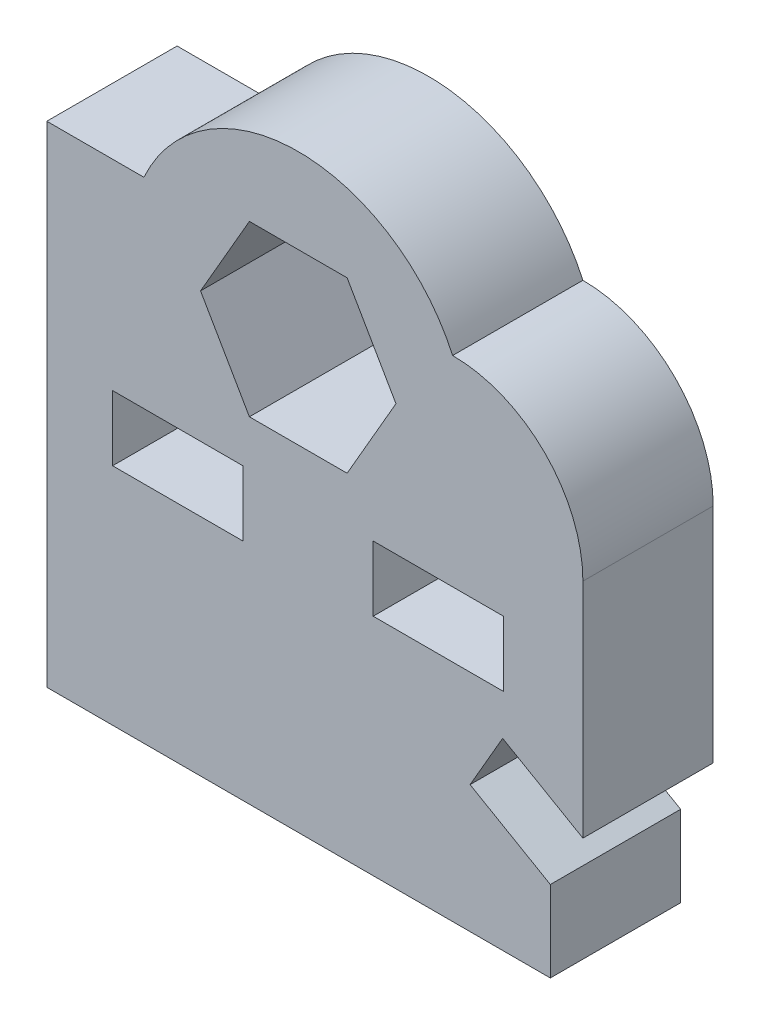
ISO-10303-21;
HEADER;
FILE_DESCRIPTION(('STEP AP214'),'2;1');
FILE_NAME('part.step','',(''),(''),'','','');
FILE_SCHEMA(('AUTOMOTIVE_DESIGN { 1 0 10303 214 1 1 1 1 }'));
ENDSEC;
DATA;
#1=APPLICATION_CONTEXT('core data for automotive mechanical design processes');
#2=APPLICATION_PROTOCOL_DEFINITION('international standard','automotive_design',2000,#1);
#3=PRODUCT_CONTEXT('',#1,'mechanical');
#4=PRODUCT('Part','Part','',(#3));
#5=PRODUCT_RELATED_PRODUCT_CATEGORY('part','',(#4));
#6=PRODUCT_DEFINITION_FORMATION('','',#4);
#7=PRODUCT_DEFINITION_CONTEXT('part definition',#1,'design');
#8=PRODUCT_DEFINITION('design','',#6,#7);
#9=PRODUCT_DEFINITION_SHAPE('','',#8);
#10=(LENGTH_UNIT() NAMED_UNIT(*) SI_UNIT(.MILLI.,.METRE.));
#11=(NAMED_UNIT(*) PLANE_ANGLE_UNIT() SI_UNIT($,.RADIAN.));
#12=(NAMED_UNIT(*) SI_UNIT($,.STERADIAN.) SOLID_ANGLE_UNIT());
#13=UNCERTAINTY_MEASURE_WITH_UNIT(LENGTH_MEASURE(1.E-05),#10,'distance_accuracy_value','');
#14=(GEOMETRIC_REPRESENTATION_CONTEXT(3) GLOBAL_UNCERTAINTY_ASSIGNED_CONTEXT((#13)) GLOBAL_UNIT_ASSIGNED_CONTEXT((#10,
#11,#12)) REPRESENTATION_CONTEXT('',''));
#15=CARTESIAN_POINT('',(0.,0.,0.));
#16=DIRECTION('',(0.,0.,1.));
#17=DIRECTION('',(1.,0.,0.));
#18=AXIS2_PLACEMENT_3D('',#15,#16,#17);
#19=CARTESIAN_POINT('',(13.9396736813884,13.1425512647541,4.));
#20=DIRECTION('',(0.,0.,1.));
#21=DIRECTION('',(1.,0.,0.));
#22=AXIS2_PLACEMENT_3D('',#19,#20,#21);
#23=PLANE('',#22);
#24=DIRECTION('',(0.,-1.,0.));
#25=VECTOR('',#24,1.);
#26=CARTESIAN_POINT('',(11.5,8.99107807997269,4.));
#27=LINE('',#26,#25);
#28=CARTESIAN_POINT('',(11.5,10.9910780799727,4.));
#29=VERTEX_POINT('',#28);
#30=CARTESIAN_POINT('',(11.5,8.99107807997269,4.));
#31=VERTEX_POINT('',#30);
#32=EDGE_CURVE('E246',#29,#31,#27,.T.);
#33=ORIENTED_EDGE('',*,*,#32,.F.);
#34=DIRECTION('',(-1.,0.,0.));
#35=VECTOR('',#34,1.);
#36=CARTESIAN_POINT('',(11.5,10.9910780799727,4.));
#37=LINE('',#36,#35);
#38=CARTESIAN_POINT('',(15.5,10.9910780799727,4.));
#39=VERTEX_POINT('',#38);
#40=EDGE_CURVE('E244',#39,#29,#37,.T.);
#41=ORIENTED_EDGE('',*,*,#40,.F.);
#42=DIRECTION('',(0.,1.,0.));
#43=VECTOR('',#42,1.);
#44=CARTESIAN_POINT('',(15.5,8.99107807997269,4.));
#45=LINE('',#44,#43);
#46=CARTESIAN_POINT('',(15.5,8.99107807997269,4.));
#47=VERTEX_POINT('',#46);
#48=EDGE_CURVE('E252',#47,#39,#45,.T.);
#49=ORIENTED_EDGE('',*,*,#48,.F.);
#50=DIRECTION('',(1.,0.,0.));
#51=VECTOR('',#50,1.);
#52=CARTESIAN_POINT('',(11.5,8.99107807997269,4.));
#53=LINE('',#52,#51);
#54=EDGE_CURVE('E249',#31,#47,#53,.T.);
#55=ORIENTED_EDGE('',*,*,#54,.F.);
#56=EDGE_LOOP('',(#33,#41,#49,#55));
#57=FACE_BOUND('',#56,.T.);
#58=CARTESIAN_POINT('',(13.9396736813884,13.1425512647541,4.));
#59=DIRECTION('',(0.,0.,1.));
#60=DIRECTION('',(1.,0.,0.));
#61=AXIS2_PLACEMENT_3D('',#58,#59,#60);
#62=CIRCLE('',#61,4.);
#63=CARTESIAN_POINT('',(17.9396736813884,13.142551264754,4.));
#64=VERTEX_POINT('',#63);
#65=CARTESIAN_POINT('',(13.9396736813883,17.1425512647541,4.));
#66=VERTEX_POINT('',#65);
#67=EDGE_CURVE('E306',#64,#66,#62,.T.);
#68=ORIENTED_EDGE('',*,*,#67,.T.);
#69=CARTESIAN_POINT('',(9.20000000000002,14.992551264754,4.));
#70=DIRECTION('',(0.,0.,1.));
#71=DIRECTION('',(1.,0.,0.));
#72=AXIS2_PLACEMENT_3D('',#69,#70,#71);
#73=CIRCLE('',#72,5.20451790332642);
#74=CARTESIAN_POINT('',(4.46032631861171,17.1425512647541,4.));
#75=VERTEX_POINT('',#74);
#76=EDGE_CURVE('E309',#66,#75,#73,.T.);
#77=ORIENTED_EDGE('',*,*,#76,.T.);
#78=DIRECTION('',(-1.,0.,0.));
#79=VECTOR('',#78,1.);
#80=CARTESIAN_POINT('',(4.46032631861171,17.1425512647541,4.));
#81=LINE('',#80,#79);
#82=CARTESIAN_POINT('',(1.48,17.1425512647541,4.));
#83=VERTEX_POINT('',#82);
#84=EDGE_CURVE('E312',#75,#83,#81,.T.);
#85=ORIENTED_EDGE('',*,*,#84,.T.);
#86=DIRECTION('',(0.,-1.,0.));
#87=VECTOR('',#86,1.);
#88=CARTESIAN_POINT('',(1.48,17.1425512647541,4.));
#89=LINE('',#88,#87);
#90=CARTESIAN_POINT('',(1.48,2.0910780799727,4.));
#91=VERTEX_POINT('',#90);
#92=EDGE_CURVE('E314',#83,#91,#89,.T.);
#93=ORIENTED_EDGE('',*,*,#92,.T.);
#94=DIRECTION('',(1.,0.,0.));
#95=VECTOR('',#94,1.);
#96=CARTESIAN_POINT('',(16.9396736813884,2.0910780799727,4.));
#97=LINE('',#96,#95);
#98=CARTESIAN_POINT('',(16.9396736813884,2.0910780799727,4.));
#99=VERTEX_POINT('',#98);
#100=EDGE_CURVE('E316',#91,#99,#97,.T.);
#101=ORIENTED_EDGE('',*,*,#100,.T.);
#102=DIRECTION('',(0.,1.,0.));
#103=VECTOR('',#102,1.);
#104=CARTESIAN_POINT('',(16.9396736813884,4.57735026918963,4.));
#105=LINE('',#104,#103);
#106=CARTESIAN_POINT('',(16.9396736813884,4.57735026918963,4.));
#107=VERTEX_POINT('',#106);
#108=EDGE_CURVE('E318',#99,#107,#105,.T.);
#109=ORIENTED_EDGE('',*,*,#108,.T.);
#110=DIRECTION('',(-0.866025403784438,0.5,0.));
#111=VECTOR('',#110,1.);
#112=CARTESIAN_POINT('',(14.4755720662506,6.,4.));
#113=LINE('',#112,#111);
#114=CARTESIAN_POINT('',(14.4755720662506,6.,4.));
#115=VERTEX_POINT('',#114);
#116=EDGE_CURVE('E320',#107,#115,#113,.T.);
#117=ORIENTED_EDGE('',*,*,#116,.T.);
#118=DIRECTION('',(0.500000000000005,0.866025403784436,0.));
#119=VECTOR('',#118,1.);
#120=CARTESIAN_POINT('',(14.4755720662506,6.,4.));
#121=LINE('',#120,#119);
#122=CARTESIAN_POINT('',(15.4755720662506,7.73205080756889,4.));
#123=VERTEX_POINT('',#122);
#124=EDGE_CURVE('E322',#115,#123,#121,.T.);
#125=ORIENTED_EDGE('',*,*,#124,.T.);
#126=DIRECTION('',(0.866025403784436,-0.500000000000005,0.));
#127=VECTOR('',#126,1.);
#128=CARTESIAN_POINT('',(15.4755720662506,7.73205080756889,4.));
#129=LINE('',#128,#127);
#130=CARTESIAN_POINT('',(17.9396736813884,6.30940107675851,4.));
#131=VERTEX_POINT('',#130);
#132=EDGE_CURVE('E324',#123,#131,#129,.T.);
#133=ORIENTED_EDGE('',*,*,#132,.T.);
#134=DIRECTION('',(0.,1.,0.));
#135=VECTOR('',#134,1.);
#136=CARTESIAN_POINT('',(17.9396736813884,13.142551264754,4.));
#137=LINE('',#136,#135);
#138=EDGE_CURVE('E326',#131,#64,#137,.T.);
#139=ORIENTED_EDGE('',*,*,#138,.T.);
#140=EDGE_LOOP('',(#68,#77,#85,#93,#101,#109,#117,#125,#133,#139));
#141=FACE_BOUND('',#140,.T.);
#142=DIRECTION('',(0.,-1.,0.));
#143=VECTOR('',#142,1.);
#144=CARTESIAN_POINT('',(3.5,8.99107807997269,4.));
#145=LINE('',#144,#143);
#146=CARTESIAN_POINT('',(3.5,10.9910780799727,4.));
#147=VERTEX_POINT('',#146);
#148=CARTESIAN_POINT('',(3.5,8.99107807997269,4.));
#149=VERTEX_POINT('',#148);
#150=EDGE_CURVE('E277',#147,#149,#145,.T.);
#151=ORIENTED_EDGE('',*,*,#150,.F.);
#152=DIRECTION('',(-1.,0.,0.));
#153=VECTOR('',#152,1.);
#154=CARTESIAN_POINT('',(3.5,10.9910780799727,4.));
#155=LINE('',#154,#153);
#156=CARTESIAN_POINT('',(7.5,10.9910780799727,4.));
#157=VERTEX_POINT('',#156);
#158=EDGE_CURVE('E275',#157,#147,#155,.T.);
#159=ORIENTED_EDGE('',*,*,#158,.F.);
#160=DIRECTION('',(0.,1.,0.));
#161=VECTOR('',#160,1.);
#162=CARTESIAN_POINT('',(7.5,8.99107807997269,4.));
#163=LINE('',#162,#161);
#164=CARTESIAN_POINT('',(7.5,8.99107807997269,4.));
#165=VERTEX_POINT('',#164);
#166=EDGE_CURVE('E283',#165,#157,#163,.T.);
#167=ORIENTED_EDGE('',*,*,#166,.F.);
#168=DIRECTION('',(1.,0.,0.));
#169=VECTOR('',#168,1.);
#170=CARTESIAN_POINT('',(3.5,8.99107807997269,4.));
#171=LINE('',#170,#169);
#172=EDGE_CURVE('E280',#149,#165,#171,.T.);
#173=ORIENTED_EDGE('',*,*,#172,.F.);
#174=EDGE_LOOP('',(#151,#159,#167,#173));
#175=FACE_BOUND('',#174,.T.);
#176=DIRECTION('',(0.500000000000001,-0.866025403784438,0.));
#177=VECTOR('',#176,1.);
#178=CARTESIAN_POINT('',(6.20000000000001,14.9910780799727,4.));
#179=LINE('',#178,#177);
#180=CARTESIAN_POINT('',(6.20000000000001,14.9910780799727,4.));
#181=VERTEX_POINT('',#180);
#182=CARTESIAN_POINT('',(7.70000000000002,12.3930018686194,4.));
#183=VERTEX_POINT('',#182);
#184=EDGE_CURVE('E201',#181,#183,#179,.T.);
#185=ORIENTED_EDGE('',*,*,#184,.F.);
#186=DIRECTION('',(-0.499999999999995,-0.866025403784442,0.));
#187=VECTOR('',#186,1.);
#188=CARTESIAN_POINT('',(7.69999999999998,17.589154291326,4.));
#189=LINE('',#188,#187);
#190=CARTESIAN_POINT('',(7.69999999999998,17.589154291326,4.));
#191=VERTEX_POINT('',#190);
#192=EDGE_CURVE('E193',#191,#181,#189,.T.);
#193=ORIENTED_EDGE('',*,*,#192,.F.);
#194=DIRECTION('',(-1.,0.,0.));
#195=VECTOR('',#194,1.);
#196=CARTESIAN_POINT('',(10.7,17.589154291326,4.));
#197=LINE('',#196,#195);
#198=CARTESIAN_POINT('',(10.7,17.589154291326,4.));
#199=VERTEX_POINT('',#198);
#200=EDGE_CURVE('E222',#199,#191,#197,.T.);
#201=ORIENTED_EDGE('',*,*,#200,.F.);
#202=DIRECTION('',(-0.500000000000007,0.866025403784435,0.));
#203=VECTOR('',#202,1.);
#204=CARTESIAN_POINT('',(12.2,14.9910780799727,4.));
#205=LINE('',#204,#203);
#206=CARTESIAN_POINT('',(12.2,14.9910780799727,4.));
#207=VERTEX_POINT('',#206);
#208=EDGE_CURVE('E220',#207,#199,#205,.T.);
#209=ORIENTED_EDGE('',*,*,#208,.F.);
#210=DIRECTION('',(0.499999999999995,0.866025403784442,0.));
#211=VECTOR('',#210,1.);
#212=CARTESIAN_POINT('',(10.7,12.3930018686194,4.));
#213=LINE('',#212,#211);
#214=CARTESIAN_POINT('',(10.7,12.3930018686194,4.));
#215=VERTEX_POINT('',#214);
#216=EDGE_CURVE('E216',#215,#207,#213,.T.);
#217=ORIENTED_EDGE('',*,*,#216,.F.);
#218=DIRECTION('',(1.,0.,0.));
#219=VECTOR('',#218,1.);
#220=CARTESIAN_POINT('',(7.70000000000002,12.3930018686194,4.));
#221=LINE('',#220,#219);
#222=EDGE_CURVE('E214',#183,#215,#221,.T.);
#223=ORIENTED_EDGE('',*,*,#222,.F.);
#224=EDGE_LOOP('',(#185,#193,#201,#209,#217,#223));
#225=FACE_BOUND('',#224,.T.);
#226=ADVANCED_FACE('F32',(#57,#141,#175,#225),#23,.T.);
#227=CARTESIAN_POINT('',(13.9396736813884,13.1425512647541,0.));
#228=DIRECTION('',(0.,0.,1.));
#229=DIRECTION('',(1.,0.,0.));
#230=AXIS2_PLACEMENT_3D('',#227,#228,#229);
#231=PLANE('',#230);
#232=DIRECTION('',(-1.,0.,0.));
#233=VECTOR('',#232,1.);
#234=CARTESIAN_POINT('',(11.5,10.9910780799727,0.));
#235=LINE('',#234,#233);
#236=CARTESIAN_POINT('',(15.5,10.9910780799727,0.));
#237=VERTEX_POINT('',#236);
#238=CARTESIAN_POINT('',(11.5,10.9910780799727,0.));
#239=VERTEX_POINT('',#238);
#240=EDGE_CURVE('E209',#237,#239,#235,.T.);
#241=ORIENTED_EDGE('',*,*,#240,.T.);
#242=DIRECTION('',(0.,-1.,0.));
#243=VECTOR('',#242,1.);
#244=CARTESIAN_POINT('',(11.5,8.99107807997269,0.));
#245=LINE('',#244,#243);
#246=CARTESIAN_POINT('',(11.5,8.99107807997269,0.));
#247=VERTEX_POINT('',#246);
#248=EDGE_CURVE('E257',#239,#247,#245,.T.);
#249=ORIENTED_EDGE('',*,*,#248,.T.);
#250=DIRECTION('',(1.,0.,0.));
#251=VECTOR('',#250,1.);
#252=CARTESIAN_POINT('',(11.5,8.99107807997269,0.));
#253=LINE('',#252,#251);
#254=CARTESIAN_POINT('',(15.5,8.99107807997269,0.));
#255=VERTEX_POINT('',#254);
#256=EDGE_CURVE('E260',#247,#255,#253,.T.);
#257=ORIENTED_EDGE('',*,*,#256,.T.);
#258=DIRECTION('',(0.,1.,0.));
#259=VECTOR('',#258,1.);
#260=CARTESIAN_POINT('',(15.5,8.99107807997269,0.));
#261=LINE('',#260,#259);
#262=EDGE_CURVE('E247',#255,#237,#261,.T.);
#263=ORIENTED_EDGE('',*,*,#262,.T.);
#264=EDGE_LOOP('',(#241,#249,#257,#263));
#265=FACE_BOUND('',#264,.T.);
#266=CARTESIAN_POINT('',(13.9396736813884,13.1425512647541,0.));
#267=DIRECTION('',(0.,0.,1.));
#268=DIRECTION('',(1.,0.,0.));
#269=AXIS2_PLACEMENT_3D('',#266,#267,#268);
#270=CIRCLE('',#269,4.);
#271=CARTESIAN_POINT('',(17.9396736813884,13.142551264754,0.));
#272=VERTEX_POINT('',#271);
#273=CARTESIAN_POINT('',(13.9396736813883,17.1425512647541,0.));
#274=VERTEX_POINT('',#273);
#275=EDGE_CURVE('E305',#272,#274,#270,.T.);
#276=ORIENTED_EDGE('',*,*,#275,.F.);
#277=DIRECTION('',(0.,1.,0.));
#278=VECTOR('',#277,1.);
#279=CARTESIAN_POINT('',(17.9396736813884,13.142551264754,0.));
#280=LINE('',#279,#278);
#281=CARTESIAN_POINT('',(17.9396736813884,6.30940107675851,0.));
#282=VERTEX_POINT('',#281);
#283=EDGE_CURVE('E310',#282,#272,#280,.T.);
#284=ORIENTED_EDGE('',*,*,#283,.F.);
#285=DIRECTION('',(0.866025403784436,-0.500000000000005,0.));
#286=VECTOR('',#285,1.);
#287=CARTESIAN_POINT('',(15.4755720662506,7.73205080756889,0.));
#288=LINE('',#287,#286);
#289=CARTESIAN_POINT('',(15.4755720662506,7.73205080756889,0.));
#290=VERTEX_POINT('',#289);
#291=EDGE_CURVE('E345',#290,#282,#288,.T.);
#292=ORIENTED_EDGE('',*,*,#291,.F.);
#293=DIRECTION('',(0.500000000000005,0.866025403784436,0.));
#294=VECTOR('',#293,1.);
#295=CARTESIAN_POINT('',(14.4755720662506,6.,0.));
#296=LINE('',#295,#294);
#297=CARTESIAN_POINT('',(14.4755720662506,6.,0.));
#298=VERTEX_POINT('',#297);
#299=EDGE_CURVE('E343',#298,#290,#296,.T.);
#300=ORIENTED_EDGE('',*,*,#299,.F.);
#301=DIRECTION('',(-0.866025403784438,0.5,0.));
#302=VECTOR('',#301,1.);
#303=CARTESIAN_POINT('',(14.4755720662506,6.,0.));
#304=LINE('',#303,#302);
#305=CARTESIAN_POINT('',(16.9396736813884,4.57735026918963,0.));
#306=VERTEX_POINT('',#305);
#307=EDGE_CURVE('E341',#306,#298,#304,.T.);
#308=ORIENTED_EDGE('',*,*,#307,.F.);
#309=DIRECTION('',(0.,1.,0.));
#310=VECTOR('',#309,1.);
#311=CARTESIAN_POINT('',(16.9396736813884,4.57735026918963,0.));
#312=LINE('',#311,#310);
#313=CARTESIAN_POINT('',(16.9396736813884,2.0910780799727,0.));
#314=VERTEX_POINT('',#313);
#315=EDGE_CURVE('E339',#314,#306,#312,.T.);
#316=ORIENTED_EDGE('',*,*,#315,.F.);
#317=DIRECTION('',(1.,0.,0.));
#318=VECTOR('',#317,1.);
#319=CARTESIAN_POINT('',(16.9396736813884,2.0910780799727,0.));
#320=LINE('',#319,#318);
#321=CARTESIAN_POINT('',(1.48,2.0910780799727,0.));
#322=VERTEX_POINT('',#321);
#323=EDGE_CURVE('E337',#322,#314,#320,.T.);
#324=ORIENTED_EDGE('',*,*,#323,.F.);
#325=DIRECTION('',(0.,-1.,0.));
#326=VECTOR('',#325,1.);
#327=CARTESIAN_POINT('',(1.48,17.1425512647541,0.));
#328=LINE('',#327,#326);
#329=CARTESIAN_POINT('',(1.48,17.1425512647541,0.));
#330=VERTEX_POINT('',#329);
#331=EDGE_CURVE('E335',#330,#322,#328,.T.);
#332=ORIENTED_EDGE('',*,*,#331,.F.);
#333=DIRECTION('',(-1.,0.,0.));
#334=VECTOR('',#333,1.);
#335=CARTESIAN_POINT('',(4.46032631861171,17.1425512647541,0.));
#336=LINE('',#335,#334);
#337=CARTESIAN_POINT('',(4.46032631861171,17.1425512647541,0.));
#338=VERTEX_POINT('',#337);
#339=EDGE_CURVE('E333',#338,#330,#336,.T.);
#340=ORIENTED_EDGE('',*,*,#339,.F.);
#341=CARTESIAN_POINT('',(9.20000000000002,14.992551264754,0.));
#342=DIRECTION('',(0.,0.,1.));
#343=DIRECTION('',(1.,0.,0.));
#344=AXIS2_PLACEMENT_3D('',#341,#342,#343);
#345=CIRCLE('',#344,5.20451790332642);
#346=EDGE_CURVE('E331',#274,#338,#345,.T.);
#347=ORIENTED_EDGE('',*,*,#346,.F.);
#348=EDGE_LOOP('',(#276,#284,#292,#300,#308,#316,#324,#332,#340,#347));
#349=FACE_BOUND('',#348,.T.);
#350=DIRECTION('',(-1.,0.,0.));
#351=VECTOR('',#350,1.);
#352=CARTESIAN_POINT('',(3.5,10.9910780799727,0.));
#353=LINE('',#352,#351);
#354=CARTESIAN_POINT('',(7.5,10.9910780799727,0.));
#355=VERTEX_POINT('',#354);
#356=CARTESIAN_POINT('',(3.5,10.9910780799727,0.));
#357=VERTEX_POINT('',#356);
#358=EDGE_CURVE('E274',#355,#357,#353,.T.);
#359=ORIENTED_EDGE('',*,*,#358,.T.);
#360=DIRECTION('',(0.,-1.,0.));
#361=VECTOR('',#360,1.);
#362=CARTESIAN_POINT('',(3.5,8.99107807997269,0.));
#363=LINE('',#362,#361);
#364=CARTESIAN_POINT('',(3.5,8.99107807997269,0.));
#365=VERTEX_POINT('',#364);
#366=EDGE_CURVE('E288',#357,#365,#363,.T.);
#367=ORIENTED_EDGE('',*,*,#366,.T.);
#368=DIRECTION('',(1.,0.,0.));
#369=VECTOR('',#368,1.);
#370=CARTESIAN_POINT('',(3.5,8.99107807997269,0.));
#371=LINE('',#370,#369);
#372=CARTESIAN_POINT('',(7.5,8.99107807997269,0.));
#373=VERTEX_POINT('',#372);
#374=EDGE_CURVE('E291',#365,#373,#371,.T.);
#375=ORIENTED_EDGE('',*,*,#374,.T.);
#376=DIRECTION('',(0.,1.,0.));
#377=VECTOR('',#376,1.);
#378=CARTESIAN_POINT('',(7.5,8.99107807997269,0.));
#379=LINE('',#378,#377);
#380=EDGE_CURVE('E278',#373,#355,#379,.T.);
#381=ORIENTED_EDGE('',*,*,#380,.T.);
#382=EDGE_LOOP('',(#359,#367,#375,#381));
#383=FACE_BOUND('',#382,.T.);
#384=DIRECTION('',(-0.499999999999995,-0.866025403784442,0.));
#385=VECTOR('',#384,1.);
#386=CARTESIAN_POINT('',(7.69999999999998,17.589154291326,0.));
#387=LINE('',#386,#385);
#388=CARTESIAN_POINT('',(7.69999999999998,17.589154291326,0.));
#389=VERTEX_POINT('',#388);
#390=CARTESIAN_POINT('',(6.20000000000001,14.9910780799727,0.));
#391=VERTEX_POINT('',#390);
#392=EDGE_CURVE('E55',#389,#391,#387,.T.);
#393=ORIENTED_EDGE('',*,*,#392,.T.);
#394=DIRECTION('',(0.500000000000001,-0.866025403784438,0.));
#395=VECTOR('',#394,1.);
#396=CARTESIAN_POINT('',(6.20000000000001,14.9910780799727,0.));
#397=LINE('',#396,#395);
#398=CARTESIAN_POINT('',(7.70000000000002,12.3930018686194,0.));
#399=VERTEX_POINT('',#398);
#400=EDGE_CURVE('E208',#391,#399,#397,.T.);
#401=ORIENTED_EDGE('',*,*,#400,.T.);
#402=DIRECTION('',(1.,0.,0.));
#403=VECTOR('',#402,1.);
#404=CARTESIAN_POINT('',(7.70000000000002,12.3930018686194,0.));
#405=LINE('',#404,#403);
#406=CARTESIAN_POINT('',(10.7,12.3930018686194,0.));
#407=VERTEX_POINT('',#406);
#408=EDGE_CURVE('E226',#399,#407,#405,.T.);
#409=ORIENTED_EDGE('',*,*,#408,.T.);
#410=DIRECTION('',(0.499999999999995,0.866025403784442,0.));
#411=VECTOR('',#410,1.);
#412=CARTESIAN_POINT('',(10.7,12.3930018686194,0.));
#413=LINE('',#412,#411);
#414=CARTESIAN_POINT('',(12.2,14.9910780799727,0.));
#415=VERTEX_POINT('',#414);
#416=EDGE_CURVE('E229',#407,#415,#413,.T.);
#417=ORIENTED_EDGE('',*,*,#416,.T.);
#418=DIRECTION('',(-0.500000000000007,0.866025403784435,0.));
#419=VECTOR('',#418,1.);
#420=CARTESIAN_POINT('',(12.2,14.9910780799727,0.));
#421=LINE('',#420,#419);
#422=CARTESIAN_POINT('',(10.7,17.589154291326,0.));
#423=VERTEX_POINT('',#422);
#424=EDGE_CURVE('E232',#415,#423,#421,.T.);
#425=ORIENTED_EDGE('',*,*,#424,.T.);
#426=DIRECTION('',(-1.,0.,0.));
#427=VECTOR('',#426,1.);
#428=CARTESIAN_POINT('',(10.7,17.589154291326,0.));
#429=LINE('',#428,#427);
#430=EDGE_CURVE('E202',#423,#389,#429,.T.);
#431=ORIENTED_EDGE('',*,*,#430,.T.);
#432=EDGE_LOOP('',(#393,#401,#409,#417,#425,#431));
#433=FACE_BOUND('',#432,.T.);
#434=ADVANCED_FACE('F381',(#265,#349,#383,#433),#231,.F.);
#435=CARTESIAN_POINT('',(13.9396736813884,13.1425512647541,4.));
#436=DIRECTION('',(0.,0.,-1.));
#437=DIRECTION('',(-1.,0.,0.));
#438=AXIS2_PLACEMENT_3D('',#435,#436,#437);
#439=CYLINDRICAL_SURFACE('',#438,4.);
#440=ORIENTED_EDGE('',*,*,#275,.T.);
#441=DIRECTION('',(0.,0.,-1.));
#442=VECTOR('',#441,1.);
#443=CARTESIAN_POINT('',(13.9396736813883,17.1425512647541,4.));
#444=LINE('',#443,#442);
#445=EDGE_CURVE('E11',#66,#274,#444,.T.);
#446=ORIENTED_EDGE('',*,*,#445,.F.);
#447=ORIENTED_EDGE('',*,*,#67,.F.);
#448=DIRECTION('',(0.,0.,-1.));
#449=VECTOR('',#448,1.);
#450=CARTESIAN_POINT('',(17.9396736813884,13.142551264754,4.));
#451=LINE('',#450,#449);
#452=EDGE_CURVE('E328',#64,#272,#451,.T.);
#453=ORIENTED_EDGE('',*,*,#452,.T.);
#454=EDGE_LOOP('',(#440,#446,#447,#453));
#455=FACE_BOUND('',#454,.T.);
#456=ADVANCED_FACE('F34',(#455),#439,.T.);
#457=CARTESIAN_POINT('',(9.20000000000002,14.992551264754,4.));
#458=DIRECTION('',(0.,0.,-1.));
#459=DIRECTION('',(-1.,0.,0.));
#460=AXIS2_PLACEMENT_3D('',#457,#458,#459);
#461=CYLINDRICAL_SURFACE('',#460,5.20451790332642);
#462=ORIENTED_EDGE('',*,*,#346,.T.);
#463=DIRECTION('',(0.,0.,-1.));
#464=VECTOR('',#463,1.);
#465=CARTESIAN_POINT('',(4.46032631861171,17.1425512647541,4.));
#466=LINE('',#465,#464);
#467=EDGE_CURVE('E40',#75,#338,#466,.T.);
#468=ORIENTED_EDGE('',*,*,#467,.F.);
#469=ORIENTED_EDGE('',*,*,#76,.F.);
#470=ORIENTED_EDGE('',*,*,#445,.T.);
#471=EDGE_LOOP('',(#462,#468,#469,#470));
#472=FACE_BOUND('',#471,.T.);
#473=ADVANCED_FACE('F399',(#472),#461,.T.);
#474=CARTESIAN_POINT('',(4.46032631861171,17.1425512647541,4.));
#475=DIRECTION('',(0.,-1.,0.));
#476=DIRECTION('',(0.,0.,-1.));
#477=AXIS2_PLACEMENT_3D('',#474,#475,#476);
#478=PLANE('',#477);
#479=ORIENTED_EDGE('',*,*,#339,.T.);
#480=DIRECTION('',(0.,0.,-1.));
#481=VECTOR('',#480,1.);
#482=CARTESIAN_POINT('',(1.48,17.1425512647541,4.));
#483=LINE('',#482,#481);
#484=EDGE_CURVE('E368',#83,#330,#483,.T.);
#485=ORIENTED_EDGE('',*,*,#484,.F.);
#486=ORIENTED_EDGE('',*,*,#84,.F.);
#487=ORIENTED_EDGE('',*,*,#467,.T.);
#488=EDGE_LOOP('',(#479,#485,#486,#487));
#489=FACE_BOUND('',#488,.T.);
#490=ADVANCED_FACE('F375',(#489),#478,.F.);
#491=CARTESIAN_POINT('',(1.48,17.1425512647541,4.));
#492=DIRECTION('',(1.,0.,0.));
#493=DIRECTION('',(0.,1.,0.));
#494=AXIS2_PLACEMENT_3D('',#491,#492,#493);
#495=PLANE('',#494);
#496=ORIENTED_EDGE('',*,*,#331,.T.);
#497=DIRECTION('',(0.,0.,-1.));
#498=VECTOR('',#497,1.);
#499=CARTESIAN_POINT('',(1.48,2.0910780799727,4.));
#500=LINE('',#499,#498);
#501=EDGE_CURVE('E365',#91,#322,#500,.T.);
#502=ORIENTED_EDGE('',*,*,#501,.F.);
#503=ORIENTED_EDGE('',*,*,#92,.F.);
#504=ORIENTED_EDGE('',*,*,#484,.T.);
#505=EDGE_LOOP('',(#496,#502,#503,#504));
#506=FACE_BOUND('',#505,.T.);
#507=ADVANCED_FACE('F387',(#506),#495,.F.);
#508=CARTESIAN_POINT('',(16.9396736813884,2.0910780799727,4.));
#509=DIRECTION('',(0.,1.,0.));
#510=DIRECTION('',(-1.,0.,0.));
#511=AXIS2_PLACEMENT_3D('',#508,#509,#510);
#512=PLANE('',#511);
#513=ORIENTED_EDGE('',*,*,#323,.T.);
#514=DIRECTION('',(0.,0.,-1.));
#515=VECTOR('',#514,1.);
#516=CARTESIAN_POINT('',(16.9396736813884,2.0910780799727,4.));
#517=LINE('',#516,#515);
#518=EDGE_CURVE('E362',#99,#314,#517,.T.);
#519=ORIENTED_EDGE('',*,*,#518,.F.);
#520=ORIENTED_EDGE('',*,*,#100,.F.);
#521=ORIENTED_EDGE('',*,*,#501,.T.);
#522=EDGE_LOOP('',(#513,#519,#520,#521));
#523=FACE_BOUND('',#522,.T.);
#524=ADVANCED_FACE('F391',(#523),#512,.F.);
#525=CARTESIAN_POINT('',(16.9396736813884,4.57735026918963,4.));
#526=DIRECTION('',(-1.,0.,0.));
#527=DIRECTION('',(0.,0.,1.));
#528=AXIS2_PLACEMENT_3D('',#525,#526,#527);
#529=PLANE('',#528);
#530=ORIENTED_EDGE('',*,*,#315,.T.);
#531=DIRECTION('',(0.,0.,-1.));
#532=VECTOR('',#531,1.);
#533=CARTESIAN_POINT('',(16.9396736813884,4.57735026918963,4.));
#534=LINE('',#533,#532);
#535=EDGE_CURVE('E359',#107,#306,#534,.T.);
#536=ORIENTED_EDGE('',*,*,#535,.F.);
#537=ORIENTED_EDGE('',*,*,#108,.F.);
#538=ORIENTED_EDGE('',*,*,#518,.T.);
#539=EDGE_LOOP('',(#530,#536,#537,#538));
#540=FACE_BOUND('',#539,.T.);
#541=ADVANCED_FACE('F422',(#540),#529,.F.);
#542=CARTESIAN_POINT('',(14.4755720662506,6.,4.));
#543=DIRECTION('',(-0.5,-0.866025403784438,0.));
#544=DIRECTION('',(0.866025403784438,-0.5,0.));
#545=AXIS2_PLACEMENT_3D('',#542,#543,#544);
#546=PLANE('',#545);
#547=ORIENTED_EDGE('',*,*,#307,.T.);
#548=DIRECTION('',(0.,0.,-1.));
#549=VECTOR('',#548,1.);
#550=CARTESIAN_POINT('',(14.4755720662506,6.,4.));
#551=LINE('',#550,#549);
#552=EDGE_CURVE('E356',#115,#298,#551,.T.);
#553=ORIENTED_EDGE('',*,*,#552,.F.);
#554=ORIENTED_EDGE('',*,*,#116,.F.);
#555=ORIENTED_EDGE('',*,*,#535,.T.);
#556=EDGE_LOOP('',(#547,#553,#554,#555));
#557=FACE_BOUND('',#556,.T.);
#558=ADVANCED_FACE('F419',(#557),#546,.F.);
#559=CARTESIAN_POINT('',(14.4755720662506,6.,4.));
#560=DIRECTION('',(-0.866025403784436,0.500000000000005,0.));
#561=DIRECTION('',(-0.500000000000005,-0.866025403784436,0.));
#562=AXIS2_PLACEMENT_3D('',#559,#560,#561);
#563=PLANE('',#562);
#564=ORIENTED_EDGE('',*,*,#299,.T.);
#565=DIRECTION('',(0.,0.,-1.));
#566=VECTOR('',#565,1.);
#567=CARTESIAN_POINT('',(15.4755720662506,7.73205080756889,4.));
#568=LINE('',#567,#566);
#569=EDGE_CURVE('E353',#123,#290,#568,.T.);
#570=ORIENTED_EDGE('',*,*,#569,.F.);
#571=ORIENTED_EDGE('',*,*,#124,.F.);
#572=ORIENTED_EDGE('',*,*,#552,.T.);
#573=EDGE_LOOP('',(#564,#570,#571,#572));
#574=FACE_BOUND('',#573,.T.);
#575=ADVANCED_FACE('F415',(#574),#563,.F.);
#576=CARTESIAN_POINT('',(15.4755720662506,7.73205080756889,4.));
#577=DIRECTION('',(0.500000000000005,0.866025403784436,0.));
#578=DIRECTION('',(-0.866025403784436,0.500000000000005,0.));
#579=AXIS2_PLACEMENT_3D('',#576,#577,#578);
#580=PLANE('',#579);
#581=ORIENTED_EDGE('',*,*,#291,.T.);
#582=DIRECTION('',(0.,0.,-1.));
#583=VECTOR('',#582,1.);
#584=CARTESIAN_POINT('',(17.9396736813884,6.30940107675851,4.));
#585=LINE('',#584,#583);
#586=EDGE_CURVE('E350',#131,#282,#585,.T.);
#587=ORIENTED_EDGE('',*,*,#586,.F.);
#588=ORIENTED_EDGE('',*,*,#132,.F.);
#589=ORIENTED_EDGE('',*,*,#569,.T.);
#590=EDGE_LOOP('',(#581,#587,#588,#589));
#591=FACE_BOUND('',#590,.T.);
#592=ADVANCED_FACE('F411',(#591),#580,.F.);
#593=CARTESIAN_POINT('',(17.9396736813884,13.142551264754,4.));
#594=DIRECTION('',(-1.,0.,0.));
#595=DIRECTION('',(0.,0.,1.));
#596=AXIS2_PLACEMENT_3D('',#593,#594,#595);
#597=PLANE('',#596);
#598=ORIENTED_EDGE('',*,*,#283,.T.);
#599=ORIENTED_EDGE('',*,*,#452,.F.);
#600=ORIENTED_EDGE('',*,*,#138,.F.);
#601=ORIENTED_EDGE('',*,*,#586,.T.);
#602=EDGE_LOOP('',(#598,#599,#600,#601));
#603=FACE_BOUND('',#602,.T.);
#604=ADVANCED_FACE('F406',(#603),#597,.F.);
#605=CARTESIAN_POINT('',(3.5,10.9910780799727,4.));
#606=DIRECTION('',(0.,-1.,0.));
#607=DIRECTION('',(0.,0.,-1.));
#608=AXIS2_PLACEMENT_3D('',#605,#606,#607);
#609=PLANE('',#608);
#610=ORIENTED_EDGE('',*,*,#358,.F.);
#611=DIRECTION('',(0.,0.,-1.));
#612=VECTOR('',#611,1.);
#613=CARTESIAN_POINT('',(7.5,10.9910780799727,4.));
#614=LINE('',#613,#612);
#615=EDGE_CURVE('E285',#157,#355,#614,.T.);
#616=ORIENTED_EDGE('',*,*,#615,.F.);
#617=ORIENTED_EDGE('',*,*,#158,.T.);
#618=DIRECTION('',(0.,0.,-1.));
#619=VECTOR('',#618,1.);
#620=CARTESIAN_POINT('',(3.5,10.9910780799727,4.));
#621=LINE('',#620,#619);
#622=EDGE_CURVE('E302',#147,#357,#621,.T.);
#623=ORIENTED_EDGE('',*,*,#622,.T.);
#624=EDGE_LOOP('',(#610,#616,#617,#623));
#625=FACE_BOUND('',#624,.T.);
#626=ADVANCED_FACE('F441',(#625),#609,.T.);
#627=CARTESIAN_POINT('',(3.5,8.99107807997269,4.));
#628=DIRECTION('',(1.,0.,0.));
#629=DIRECTION('',(0.,0.,-1.));
#630=AXIS2_PLACEMENT_3D('',#627,#628,#629);
#631=PLANE('',#630);
#632=ORIENTED_EDGE('',*,*,#366,.F.);
#633=ORIENTED_EDGE('',*,*,#622,.F.);
#634=ORIENTED_EDGE('',*,*,#150,.T.);
#635=DIRECTION('',(0.,0.,-1.));
#636=VECTOR('',#635,1.);
#637=CARTESIAN_POINT('',(3.5,8.99107807997269,4.));
#638=LINE('',#637,#636);
#639=EDGE_CURVE('E300',#149,#365,#638,.T.);
#640=ORIENTED_EDGE('',*,*,#639,.T.);
#641=EDGE_LOOP('',(#632,#633,#634,#640));
#642=FACE_BOUND('',#641,.T.);
#643=ADVANCED_FACE('F467',(#642),#631,.T.);
#644=CARTESIAN_POINT('',(3.5,8.99107807997269,4.));
#645=DIRECTION('',(0.,1.,0.));
#646=DIRECTION('',(0.,0.,1.));
#647=AXIS2_PLACEMENT_3D('',#644,#645,#646);
#648=PLANE('',#647);
#649=ORIENTED_EDGE('',*,*,#374,.F.);
#650=ORIENTED_EDGE('',*,*,#639,.F.);
#651=ORIENTED_EDGE('',*,*,#172,.T.);
#652=DIRECTION('',(0.,0.,-1.));
#653=VECTOR('',#652,1.);
#654=CARTESIAN_POINT('',(7.5,8.99107807997269,4.));
#655=LINE('',#654,#653);
#656=EDGE_CURVE('E298',#165,#373,#655,.T.);
#657=ORIENTED_EDGE('',*,*,#656,.T.);
#658=EDGE_LOOP('',(#649,#650,#651,#657));
#659=FACE_BOUND('',#658,.T.);
#660=ADVANCED_FACE('F474',(#659),#648,.T.);
#661=CARTESIAN_POINT('',(7.5,8.99107807997269,4.));
#662=DIRECTION('',(-1.,0.,0.));
#663=DIRECTION('',(0.,0.,1.));
#664=AXIS2_PLACEMENT_3D('',#661,#662,#663);
#665=PLANE('',#664);
#666=ORIENTED_EDGE('',*,*,#380,.F.);
#667=ORIENTED_EDGE('',*,*,#656,.F.);
#668=ORIENTED_EDGE('',*,*,#166,.T.);
#669=ORIENTED_EDGE('',*,*,#615,.T.);
#670=EDGE_LOOP('',(#666,#667,#668,#669));
#671=FACE_BOUND('',#670,.T.);
#672=ADVANCED_FACE('F481',(#671),#665,.T.);
#673=CARTESIAN_POINT('',(11.5,10.9910780799727,4.));
#674=DIRECTION('',(0.,-1.,0.));
#675=DIRECTION('',(0.,0.,-1.));
#676=AXIS2_PLACEMENT_3D('',#673,#674,#675);
#677=PLANE('',#676);
#678=ORIENTED_EDGE('',*,*,#240,.F.);
#679=DIRECTION('',(0.,0.,-1.));
#680=VECTOR('',#679,1.);
#681=CARTESIAN_POINT('',(15.5,10.9910780799727,4.));
#682=LINE('',#681,#680);
#683=EDGE_CURVE('E254',#39,#237,#682,.T.);
#684=ORIENTED_EDGE('',*,*,#683,.F.);
#685=ORIENTED_EDGE('',*,*,#40,.T.);
#686=DIRECTION('',(0.,0.,-1.));
#687=VECTOR('',#686,1.);
#688=CARTESIAN_POINT('',(11.5,10.9910780799727,4.));
#689=LINE('',#688,#687);
#690=EDGE_CURVE('E271',#29,#239,#689,.T.);
#691=ORIENTED_EDGE('',*,*,#690,.T.);
#692=EDGE_LOOP('',(#678,#684,#685,#691));
#693=FACE_BOUND('',#692,.T.);
#694=ADVANCED_FACE('F489',(#693),#677,.T.);
#695=CARTESIAN_POINT('',(11.5,8.99107807997269,4.));
#696=DIRECTION('',(1.,0.,0.));
#697=DIRECTION('',(0.,0.,-1.));
#698=AXIS2_PLACEMENT_3D('',#695,#696,#697);
#699=PLANE('',#698);
#700=ORIENTED_EDGE('',*,*,#248,.F.);
#701=ORIENTED_EDGE('',*,*,#690,.F.);
#702=ORIENTED_EDGE('',*,*,#32,.T.);
#703=DIRECTION('',(0.,0.,-1.));
#704=VECTOR('',#703,1.);
#705=CARTESIAN_POINT('',(11.5,8.99107807997269,4.));
#706=LINE('',#705,#704);
#707=EDGE_CURVE('E269',#31,#247,#706,.T.);
#708=ORIENTED_EDGE('',*,*,#707,.T.);
#709=EDGE_LOOP('',(#700,#701,#702,#708));
#710=FACE_BOUND('',#709,.T.);
#711=ADVANCED_FACE('F497',(#710),#699,.T.);
#712=CARTESIAN_POINT('',(11.5,8.99107807997269,4.));
#713=DIRECTION('',(0.,1.,0.));
#714=DIRECTION('',(0.,0.,1.));
#715=AXIS2_PLACEMENT_3D('',#712,#713,#714);
#716=PLANE('',#715);
#717=ORIENTED_EDGE('',*,*,#256,.F.);
#718=ORIENTED_EDGE('',*,*,#707,.F.);
#719=ORIENTED_EDGE('',*,*,#54,.T.);
#720=DIRECTION('',(0.,0.,-1.));
#721=VECTOR('',#720,1.);
#722=CARTESIAN_POINT('',(15.5,8.99107807997269,4.));
#723=LINE('',#722,#721);
#724=EDGE_CURVE('E267',#47,#255,#723,.T.);
#725=ORIENTED_EDGE('',*,*,#724,.T.);
#726=EDGE_LOOP('',(#717,#718,#719,#725));
#727=FACE_BOUND('',#726,.T.);
#728=ADVANCED_FACE('F505',(#727),#716,.T.);
#729=CARTESIAN_POINT('',(15.5,8.99107807997269,4.));
#730=DIRECTION('',(-1.,0.,0.));
#731=DIRECTION('',(0.,0.,1.));
#732=AXIS2_PLACEMENT_3D('',#729,#730,#731);
#733=PLANE('',#732);
#734=ORIENTED_EDGE('',*,*,#262,.F.);
#735=ORIENTED_EDGE('',*,*,#724,.F.);
#736=ORIENTED_EDGE('',*,*,#48,.T.);
#737=ORIENTED_EDGE('',*,*,#683,.T.);
#738=EDGE_LOOP('',(#734,#735,#736,#737));
#739=FACE_BOUND('',#738,.T.);
#740=ADVANCED_FACE('F513',(#739),#733,.T.);
#741=CARTESIAN_POINT('',(7.69999999999998,17.589154291326,4.));
#742=DIRECTION('',(0.866025403784442,-0.499999999999995,0.));
#743=DIRECTION('',(0.499999999999995,0.866025403784442,0.));
#744=AXIS2_PLACEMENT_3D('',#741,#742,#743);
#745=PLANE('',#744);
#746=ORIENTED_EDGE('',*,*,#392,.F.);
#747=DIRECTION('',(0.,0.,-1.));
#748=VECTOR('',#747,1.);
#749=CARTESIAN_POINT('',(7.69999999999998,17.589154291326,4.));
#750=LINE('',#749,#748);
#751=EDGE_CURVE('E197',#191,#389,#750,.T.);
#752=ORIENTED_EDGE('',*,*,#751,.F.);
#753=ORIENTED_EDGE('',*,*,#192,.T.);
#754=DIRECTION('',(0.,0.,-1.));
#755=VECTOR('',#754,1.);
#756=CARTESIAN_POINT('',(6.20000000000001,14.9910780799727,4.));
#757=LINE('',#756,#755);
#758=EDGE_CURVE('E196',#181,#391,#757,.T.);
#759=ORIENTED_EDGE('',*,*,#758,.T.);
#760=EDGE_LOOP('',(#746,#752,#753,#759));
#761=FACE_BOUND('',#760,.T.);
#762=ADVANCED_FACE('F195',(#761),#745,.T.);
#763=CARTESIAN_POINT('',(6.20000000000001,14.9910780799727,4.));
#764=DIRECTION('',(0.866025403784438,0.500000000000001,0.));
#765=DIRECTION('',(-0.500000000000001,0.866025403784438,0.));
#766=AXIS2_PLACEMENT_3D('',#763,#764,#765);
#767=PLANE('',#766);
#768=ORIENTED_EDGE('',*,*,#400,.F.);
#769=ORIENTED_EDGE('',*,*,#758,.F.);
#770=ORIENTED_EDGE('',*,*,#184,.T.);
#771=DIRECTION('',(0.,0.,-1.));
#772=VECTOR('',#771,1.);
#773=CARTESIAN_POINT('',(7.70000000000002,12.3930018686194,4.));
#774=LINE('',#773,#772);
#775=EDGE_CURVE('E210',#183,#399,#774,.T.);
#776=ORIENTED_EDGE('',*,*,#775,.T.);
#777=EDGE_LOOP('',(#768,#769,#770,#776));
#778=FACE_BOUND('',#777,.T.);
#779=ADVANCED_FACE('F205',(#778),#767,.T.);
#780=CARTESIAN_POINT('',(7.70000000000002,12.3930018686194,4.));
#781=DIRECTION('',(0.,1.,0.));
#782=DIRECTION('',(-1.,0.,0.));
#783=AXIS2_PLACEMENT_3D('',#780,#781,#782);
#784=PLANE('',#783);
#785=ORIENTED_EDGE('',*,*,#408,.F.);
#786=ORIENTED_EDGE('',*,*,#775,.F.);
#787=ORIENTED_EDGE('',*,*,#222,.T.);
#788=DIRECTION('',(0.,0.,-1.));
#789=VECTOR('',#788,1.);
#790=CARTESIAN_POINT('',(10.7,12.3930018686194,4.));
#791=LINE('',#790,#789);
#792=EDGE_CURVE('E241',#215,#407,#791,.T.);
#793=ORIENTED_EDGE('',*,*,#792,.T.);
#794=EDGE_LOOP('',(#785,#786,#787,#793));
#795=FACE_BOUND('',#794,.T.);
#796=ADVANCED_FACE('F534',(#795),#784,.T.);
#797=CARTESIAN_POINT('',(10.7,12.3930018686194,4.));
#798=DIRECTION('',(-0.866025403784442,0.499999999999995,0.));
#799=DIRECTION('',(-0.499999999999995,-0.866025403784442,0.));
#800=AXIS2_PLACEMENT_3D('',#797,#798,#799);
#801=PLANE('',#800);
#802=ORIENTED_EDGE('',*,*,#416,.F.);
#803=ORIENTED_EDGE('',*,*,#792,.F.);
#804=ORIENTED_EDGE('',*,*,#216,.T.);
#805=DIRECTION('',(0.,0.,-1.));
#806=VECTOR('',#805,1.);
#807=CARTESIAN_POINT('',(12.2,14.9910780799727,4.));
#808=LINE('',#807,#806);
#809=EDGE_CURVE('E239',#207,#415,#808,.T.);
#810=ORIENTED_EDGE('',*,*,#809,.T.);
#811=EDGE_LOOP('',(#802,#803,#804,#810));
#812=FACE_BOUND('',#811,.T.);
#813=ADVANCED_FACE('F541',(#812),#801,.T.);
#814=CARTESIAN_POINT('',(12.2,14.9910780799727,4.));
#815=DIRECTION('',(-0.866025403784435,-0.500000000000007,0.));
#816=DIRECTION('',(0.500000000000007,-0.866025403784435,0.));
#817=AXIS2_PLACEMENT_3D('',#814,#815,#816);
#818=PLANE('',#817);
#819=ORIENTED_EDGE('',*,*,#424,.F.);
#820=ORIENTED_EDGE('',*,*,#809,.F.);
#821=ORIENTED_EDGE('',*,*,#208,.T.);
#822=DIRECTION('',(0.,0.,-1.));
#823=VECTOR('',#822,1.);
#824=CARTESIAN_POINT('',(10.7,17.589154291326,4.));
#825=LINE('',#824,#823);
#826=EDGE_CURVE('E47',#199,#423,#825,.T.);
#827=ORIENTED_EDGE('',*,*,#826,.T.);
#828=EDGE_LOOP('',(#819,#820,#821,#827));
#829=FACE_BOUND('',#828,.T.);
#830=ADVANCED_FACE('F549',(#829),#818,.T.);
#831=CARTESIAN_POINT('',(10.7,17.589154291326,4.));
#832=DIRECTION('',(0.,-1.,0.));
#833=DIRECTION('',(1.,0.,0.));
#834=AXIS2_PLACEMENT_3D('',#831,#832,#833);
#835=PLANE('',#834);
#836=ORIENTED_EDGE('',*,*,#430,.F.);
#837=ORIENTED_EDGE('',*,*,#826,.F.);
#838=ORIENTED_EDGE('',*,*,#200,.T.);
#839=ORIENTED_EDGE('',*,*,#751,.T.);
#840=EDGE_LOOP('',(#836,#837,#838,#839));
#841=FACE_BOUND('',#840,.T.);
#842=ADVANCED_FACE('F557',(#841),#835,.T.);
#843=CLOSED_SHELL('',(#226,#434,#456,#473,#490,#507,#524,#541,#558,#575,#592,#604,#626,#643,
#660,#672,#694,#711,#728,#740,#762,#779,#796,#813,#830,#842));
#844=MANIFOLD_SOLID_BREP('B2',#843);
#845=ADVANCED_BREP_SHAPE_REPRESENTATION('',(#18,#844),#14);
#846=SHAPE_DEFINITION_REPRESENTATION(#9,#845);
ENDSEC;
END-ISO-10303-21;
